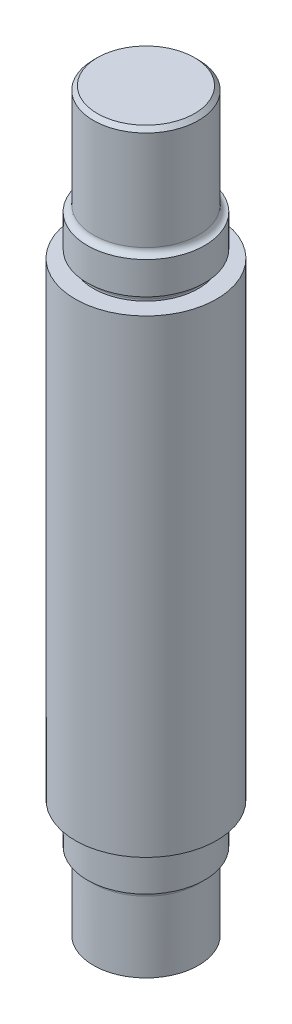
ISO-10303-21;
HEADER;
FILE_DESCRIPTION(('STEP AP214'),'2;1');
FILE_NAME('part.step','',(''),(''),'','','');
FILE_SCHEMA(('AUTOMOTIVE_DESIGN { 1 0 10303 214 1 1 1 1 }'));
ENDSEC;
DATA;
#1=APPLICATION_CONTEXT('core data for automotive mechanical design processes');
#2=APPLICATION_PROTOCOL_DEFINITION('international standard','automotive_design',2000,#1);
#3=PRODUCT_CONTEXT('',#1,'mechanical');
#4=PRODUCT('Part','Part','',(#3));
#5=PRODUCT_RELATED_PRODUCT_CATEGORY('part','',(#4));
#6=PRODUCT_DEFINITION_FORMATION('','',#4);
#7=PRODUCT_DEFINITION_CONTEXT('part definition',#1,'design');
#8=PRODUCT_DEFINITION('design','',#6,#7);
#9=PRODUCT_DEFINITION_SHAPE('','',#8);
#10=(LENGTH_UNIT() NAMED_UNIT(*) SI_UNIT(.MILLI.,.METRE.));
#11=(NAMED_UNIT(*) PLANE_ANGLE_UNIT() SI_UNIT($,.RADIAN.));
#12=(NAMED_UNIT(*) SI_UNIT($,.STERADIAN.) SOLID_ANGLE_UNIT());
#13=UNCERTAINTY_MEASURE_WITH_UNIT(LENGTH_MEASURE(1.E-05),#10,'distance_accuracy_value','');
#14=(GEOMETRIC_REPRESENTATION_CONTEXT(3) GLOBAL_UNCERTAINTY_ASSIGNED_CONTEXT((#13)) GLOBAL_UNIT_ASSIGNED_CONTEXT((#10,
#11,#12)) REPRESENTATION_CONTEXT('',''));
#15=CARTESIAN_POINT('',(0.,0.,0.));
#16=DIRECTION('',(0.,0.,1.));
#17=DIRECTION('',(1.,0.,0.));
#18=AXIS2_PLACEMENT_3D('',#15,#16,#17);
#19=CARTESIAN_POINT('',(-0.150000000000039,98.7262640233798,0.));
#20=DIRECTION('',(0.,1.,0.));
#21=DIRECTION('',(-1.,0.,0.));
#22=AXIS2_PLACEMENT_3D('',#19,#20,#21);
#23=CYLINDRICAL_SURFACE('',#22,22.4);
#24=CARTESIAN_POINT('',(-0.150000000000034,54.7262640233798,0.));
#25=DIRECTION('',(0.,1.,0.));
#26=DIRECTION('',(-1.,0.,0.));
#27=AXIS2_PLACEMENT_3D('',#24,#25,#26);
#28=CIRCLE('',#27,22.4);
#29=CARTESIAN_POINT('',(-22.55,54.7262640233798,0.));
#30=VERTEX_POINT('',#29);
#31=EDGE_CURVE('E56',#30,#30,#28,.T.);
#32=ORIENTED_EDGE('',*,*,#31,.T.);
#33=EDGE_LOOP('',(#32));
#34=FACE_BOUND('',#33,.T.);
#35=CARTESIAN_POINT('',(-0.150000000000039,97.0262640233799,0.));
#36=DIRECTION('',(0.,1.,0.));
#37=DIRECTION('',(-1.,0.,0.));
#38=AXIS2_PLACEMENT_3D('',#35,#36,#37);
#39=CIRCLE('',#38,22.4);
#40=CARTESIAN_POINT('',(-22.55,97.0262640233799,0.));
#41=VERTEX_POINT('',#40);
#42=EDGE_CURVE('E62',#41,#41,#39,.F.);
#43=ORIENTED_EDGE('',*,*,#42,.T.);
#44=EDGE_LOOP('',(#43));
#45=FACE_BOUND('',#44,.T.);
#46=ADVANCED_FACE('F38',(#34,#45),#23,.T.);
#47=CARTESIAN_POINT('',(-0.150000000000039,98.7262640233798,0.));
#48=DIRECTION('',(0.,1.,0.));
#49=DIRECTION('',(-1.,0.,0.));
#50=AXIS2_PLACEMENT_3D('',#47,#48,#49);
#51=CYLINDRICAL_SURFACE('',#50,25.);
#52=CARTESIAN_POINT('',(-0.150000000000032,38.3262640233798,0.));
#53=DIRECTION('',(0.,1.,0.));
#54=DIRECTION('',(-1.,0.,0.));
#55=AXIS2_PLACEMENT_3D('',#52,#53,#54);
#56=CIRCLE('',#55,25.);
#57=CARTESIAN_POINT('',(-25.15,38.3262640233798,0.));
#58=VERTEX_POINT('',#57);
#59=EDGE_CURVE('E74',#58,#58,#56,.T.);
#60=ORIENTED_EDGE('',*,*,#59,.T.);
#61=EDGE_LOOP('',(#60));
#62=FACE_BOUND('',#61,.T.);
#63=CARTESIAN_POINT('',(-0.150000000000034,52.1262640233798,0.));
#64=DIRECTION('',(0.,1.,0.));
#65=DIRECTION('',(-1.,0.,0.));
#66=AXIS2_PLACEMENT_3D('',#63,#64,#65);
#67=CIRCLE('',#66,25.);
#68=CARTESIAN_POINT('',(-25.15,52.1262640233798,0.));
#69=VERTEX_POINT('',#68);
#70=EDGE_CURVE('E70',#69,#69,#67,.T.);
#71=ORIENTED_EDGE('',*,*,#70,.F.);
#72=EDGE_LOOP('',(#71));
#73=FACE_BOUND('',#72,.T.);
#74=ADVANCED_FACE('F123',(#62,#73),#51,.T.);
#75=CARTESIAN_POINT('',(-0.150000000000039,98.7262640233798,0.));
#76=DIRECTION('',(0.,1.,0.));
#77=DIRECTION('',(-1.,0.,0.));
#78=AXIS2_PLACEMENT_3D('',#75,#76,#77);
#79=CYLINDRICAL_SURFACE('',#78,22.4);
#80=CARTESIAN_POINT('',(-0.150000000000032,35.7262640233798,0.));
#81=DIRECTION('',(0.,-1.,0.));
#82=DIRECTION('',(1.,0.,0.));
#83=AXIS2_PLACEMENT_3D('',#80,#81,#82);
#84=CIRCLE('',#83,22.4);
#85=CARTESIAN_POINT('',(22.2499999999999,35.7262640233798,0.));
#86=VERTEX_POINT('',#85);
#87=EDGE_CURVE('E51',#86,#86,#84,.T.);
#88=ORIENTED_EDGE('',*,*,#87,.T.);
#89=EDGE_LOOP('',(#88));
#90=FACE_BOUND('',#89,.T.);
#91=CARTESIAN_POINT('',(-0.150000000000031,34.9262640233798,0.));
#92=DIRECTION('',(0.,1.,0.));
#93=DIRECTION('',(-1.,0.,0.));
#94=AXIS2_PLACEMENT_3D('',#91,#92,#93);
#95=CIRCLE('',#94,22.4);
#96=CARTESIAN_POINT('',(-22.55,34.9262640233798,0.));
#97=VERTEX_POINT('',#96);
#98=EDGE_CURVE('E78',#97,#97,#95,.T.);
#99=ORIENTED_EDGE('',*,*,#98,.T.);
#100=EDGE_LOOP('',(#99));
#101=FACE_BOUND('',#100,.T.);
#102=ADVANCED_FACE('F129',(#90,#101),#79,.T.);
#103=CARTESIAN_POINT('',(-22.55,34.9262640233798,0.));
#104=DIRECTION('',(0.,1.,0.));
#105=DIRECTION('',(-1.,0.,0.));
#106=AXIS2_PLACEMENT_3D('',#103,#104,#105);
#107=PLANE('',#106);
#108=CARTESIAN_POINT('',(-0.150000000000031,34.9262640233798,0.));
#109=DIRECTION('',(0.,1.,0.));
#110=DIRECTION('',(-1.,0.,0.));
#111=AXIS2_PLACEMENT_3D('',#108,#109,#110);
#112=CIRCLE('',#111,30.15);
#113=CARTESIAN_POINT('',(-30.3,34.9262640233798,0.));
#114=VERTEX_POINT('',#113);
#115=EDGE_CURVE('E82',#114,#114,#112,.T.);
#116=ORIENTED_EDGE('',*,*,#115,.T.);
#117=EDGE_LOOP('',(#116));
#118=FACE_BOUND('',#117,.T.);
#119=ORIENTED_EDGE('',*,*,#98,.F.);
#120=EDGE_LOOP('',(#119));
#121=FACE_BOUND('',#120,.T.);
#122=ADVANCED_FACE('F173',(#118,#121),#107,.T.);
#123=CARTESIAN_POINT('',(-0.150000000000039,98.7262640233798,0.));
#124=DIRECTION('',(0.,1.,0.));
#125=DIRECTION('',(-1.,0.,0.));
#126=AXIS2_PLACEMENT_3D('',#123,#124,#125);
#127=CYLINDRICAL_SURFACE('',#126,30.15);
#128=CARTESIAN_POINT('',(-0.150000000000008,-165.07373597662,0.));
#129=DIRECTION('',(0.,1.,0.));
#130=DIRECTION('',(-1.,0.,0.));
#131=AXIS2_PLACEMENT_3D('',#128,#129,#130);
#132=CIRCLE('',#131,30.15);
#133=CARTESIAN_POINT('',(-30.3,-165.07373597662,0.));
#134=VERTEX_POINT('',#133);
#135=EDGE_CURVE('E86',#134,#134,#132,.T.);
#136=ORIENTED_EDGE('',*,*,#135,.T.);
#137=EDGE_LOOP('',(#136));
#138=FACE_BOUND('',#137,.T.);
#139=ORIENTED_EDGE('',*,*,#115,.F.);
#140=EDGE_LOOP('',(#139));
#141=FACE_BOUND('',#140,.T.);
#142=ADVANCED_FACE('F169',(#138,#141),#127,.T.);
#143=CARTESIAN_POINT('',(-22.55,-165.07373597662,0.));
#144=DIRECTION('',(0.,-1.,0.));
#145=DIRECTION('',(1.,0.,0.));
#146=AXIS2_PLACEMENT_3D('',#143,#144,#145);
#147=PLANE('',#146);
#148=CARTESIAN_POINT('',(-0.150000000000008,-165.07373597662,0.));
#149=DIRECTION('',(0.,1.,0.));
#150=DIRECTION('',(-1.,0.,0.));
#151=AXIS2_PLACEMENT_3D('',#148,#149,#150);
#152=CIRCLE('',#151,22.4);
#153=CARTESIAN_POINT('',(-22.55,-165.07373597662,0.));
#154=VERTEX_POINT('',#153);
#155=EDGE_CURVE('E90',#154,#154,#152,.T.);
#156=ORIENTED_EDGE('',*,*,#155,.T.);
#157=EDGE_LOOP('',(#156));
#158=FACE_BOUND('',#157,.T.);
#159=ORIENTED_EDGE('',*,*,#135,.F.);
#160=EDGE_LOOP('',(#159));
#161=FACE_BOUND('',#160,.T.);
#162=ADVANCED_FACE('F164',(#158,#161),#147,.T.);
#163=CARTESIAN_POINT('',(-0.150000000000039,98.7262640233798,0.));
#164=DIRECTION('',(0.,1.,0.));
#165=DIRECTION('',(-1.,0.,0.));
#166=AXIS2_PLACEMENT_3D('',#163,#164,#165);
#167=CYLINDRICAL_SURFACE('',#166,22.4);
#168=CARTESIAN_POINT('',(-0.150000000000008,-165.87373597662,0.));
#169=DIRECTION('',(0.,1.,0.));
#170=DIRECTION('',(-1.,0.,0.));
#171=AXIS2_PLACEMENT_3D('',#168,#169,#170);
#172=CIRCLE('',#171,22.4);
#173=CARTESIAN_POINT('',(-22.55,-165.87373597662,0.));
#174=VERTEX_POINT('',#173);
#175=EDGE_CURVE('E10',#174,#174,#172,.T.);
#176=ORIENTED_EDGE('',*,*,#175,.T.);
#177=EDGE_LOOP('',(#176));
#178=FACE_BOUND('',#177,.T.);
#179=ORIENTED_EDGE('',*,*,#155,.F.);
#180=EDGE_LOOP('',(#179));
#181=FACE_BOUND('',#180,.T.);
#182=ADVANCED_FACE('F157',(#178,#181),#167,.T.);
#183=CARTESIAN_POINT('',(-0.150000000000039,98.7262640233798,0.));
#184=DIRECTION('',(0.,1.,0.));
#185=DIRECTION('',(-1.,0.,0.));
#186=AXIS2_PLACEMENT_3D('',#183,#184,#185);
#187=CYLINDRICAL_SURFACE('',#186,25.);
#188=CARTESIAN_POINT('',(-0.150000000000006,-182.27373597662,0.));
#189=DIRECTION('',(0.,1.,0.));
#190=DIRECTION('',(-1.,0.,0.));
#191=AXIS2_PLACEMENT_3D('',#188,#189,#190);
#192=CIRCLE('',#191,25.);
#193=CARTESIAN_POINT('',(-25.15,-182.27373597662,0.));
#194=VERTEX_POINT('',#193);
#195=EDGE_CURVE('E98',#194,#194,#192,.T.);
#196=ORIENTED_EDGE('',*,*,#195,.T.);
#197=EDGE_LOOP('',(#196));
#198=FACE_BOUND('',#197,.T.);
#199=CARTESIAN_POINT('',(-0.150000000000008,-168.47373597662,0.));
#200=DIRECTION('',(0.,1.,0.));
#201=DIRECTION('',(-1.,0.,0.));
#202=AXIS2_PLACEMENT_3D('',#199,#200,#201);
#203=CIRCLE('',#202,25.);
#204=CARTESIAN_POINT('',(-25.15,-168.47373597662,0.));
#205=VERTEX_POINT('',#204);
#206=EDGE_CURVE('E94',#205,#205,#203,.T.);
#207=ORIENTED_EDGE('',*,*,#206,.F.);
#208=EDGE_LOOP('',(#207));
#209=FACE_BOUND('',#208,.T.);
#210=ADVANCED_FACE('F120',(#198,#209),#187,.T.);
#211=CARTESIAN_POINT('',(-0.150000000000039,98.7262640233798,0.));
#212=DIRECTION('',(0.,1.,0.));
#213=DIRECTION('',(-1.,0.,0.));
#214=AXIS2_PLACEMENT_3D('',#211,#212,#213);
#215=CYLINDRICAL_SURFACE('',#214,22.4);
#216=CARTESIAN_POINT('',(-0.150000000000006,-184.87373597662,0.));
#217=DIRECTION('',(0.,-1.,0.));
#218=DIRECTION('',(1.,0.,0.));
#219=AXIS2_PLACEMENT_3D('',#216,#217,#218);
#220=CIRCLE('',#219,22.4);
#221=CARTESIAN_POINT('',(22.25,-184.87373597662,0.));
#222=VERTEX_POINT('',#221);
#223=EDGE_CURVE('E46',#222,#222,#220,.T.);
#224=ORIENTED_EDGE('',*,*,#223,.T.);
#225=EDGE_LOOP('',(#224));
#226=FACE_BOUND('',#225,.T.);
#227=CARTESIAN_POINT('',(-0.150000000000002,-215.07373597662,0.));
#228=DIRECTION('',(0.,1.,0.));
#229=DIRECTION('',(-1.,0.,0.));
#230=AXIS2_PLACEMENT_3D('',#227,#228,#229);
#231=CIRCLE('',#230,22.4);
#232=CARTESIAN_POINT('',(-22.55,-215.07373597662,0.));
#233=VERTEX_POINT('',#232);
#234=EDGE_CURVE('E102',#233,#233,#231,.T.);
#235=ORIENTED_EDGE('',*,*,#234,.T.);
#236=EDGE_LOOP('',(#235));
#237=FACE_BOUND('',#236,.T.);
#238=ADVANCED_FACE('F107',(#226,#237),#215,.T.);
#239=CARTESIAN_POINT('',(-22.55,-215.07373597662,0.));
#240=DIRECTION('',(0.,-1.,0.));
#241=DIRECTION('',(1.,0.,0.));
#242=AXIS2_PLACEMENT_3D('',#239,#240,#241);
#243=PLANE('',#242);
#244=ORIENTED_EDGE('',*,*,#234,.F.);
#245=EDGE_LOOP('',(#244));
#246=FACE_BOUND('',#245,.T.);
#247=ADVANCED_FACE('F109',(#246),#243,.T.);
#248=CARTESIAN_POINT('',(-22.55,98.7262640233798,0.));
#249=DIRECTION('',(0.,1.,0.));
#250=DIRECTION('',(-1.,0.,0.));
#251=AXIS2_PLACEMENT_3D('',#248,#249,#250);
#252=PLANE('',#251);
#253=CARTESIAN_POINT('',(-0.150000000000039,98.7262640233798,0.));
#254=DIRECTION('',(0.,1.,0.));
#255=DIRECTION('',(-1.,0.,0.));
#256=AXIS2_PLACEMENT_3D('',#253,#254,#255);
#257=CIRCLE('',#256,20.7);
#258=CARTESIAN_POINT('',(-20.85,98.7262640233798,0.));
#259=VERTEX_POINT('',#258);
#260=EDGE_CURVE('E66',#259,#259,#257,.T.);
#261=ORIENTED_EDGE('',*,*,#260,.T.);
#262=EDGE_LOOP('',(#261));
#263=FACE_BOUND('',#262,.T.);
#264=ADVANCED_FACE('F111',(#263),#252,.T.);
#265=CARTESIAN_POINT('',(-0.150000000000039,98.7262640233798,0.));
#266=DIRECTION('',(0.,-1.,0.));
#267=DIRECTION('',(1.,0.,0.));
#268=AXIS2_PLACEMENT_3D('',#265,#266,#267);
#269=CONICAL_SURFACE('',#268,20.7,0.785398163397447);
#270=ORIENTED_EDGE('',*,*,#42,.F.);
#271=EDGE_LOOP('',(#270));
#272=FACE_BOUND('',#271,.T.);
#273=ORIENTED_EDGE('',*,*,#260,.F.);
#274=EDGE_LOOP('',(#273));
#275=FACE_BOUND('',#274,.T.);
#276=ADVANCED_FACE('F117',(#272,#275),#269,.T.);
#277=CARTESIAN_POINT('',(-0.150000000000034,54.7262640233798,0.));
#278=DIRECTION('',(0.,1.,0.));
#279=DIRECTION('',(-1.,0.,0.));
#280=AXIS2_PLACEMENT_3D('',#277,#278,#279);
#281=TOROIDAL_SURFACE('',#280,25.,2.6);
#282=ORIENTED_EDGE('',*,*,#70,.T.);
#283=EDGE_LOOP('',(#282));
#284=FACE_BOUND('',#283,.T.);
#285=ORIENTED_EDGE('',*,*,#31,.F.);
#286=EDGE_LOOP('',(#285));
#287=FACE_BOUND('',#286,.T.);
#288=ADVANCED_FACE('F137',(#284,#287),#281,.F.);
#289=CARTESIAN_POINT('',(-0.150000000000032,35.7262640233798,0.));
#290=DIRECTION('',(0.,-1.,0.));
#291=DIRECTION('',(1.,0.,0.));
#292=AXIS2_PLACEMENT_3D('',#289,#290,#291);
#293=TOROIDAL_SURFACE('',#292,25.,2.6);
#294=ORIENTED_EDGE('',*,*,#87,.F.);
#295=EDGE_LOOP('',(#294));
#296=FACE_BOUND('',#295,.T.);
#297=ORIENTED_EDGE('',*,*,#59,.F.);
#298=EDGE_LOOP('',(#297));
#299=FACE_BOUND('',#298,.T.);
#300=ADVANCED_FACE('F141',(#296,#299),#293,.F.);
#301=CARTESIAN_POINT('',(-0.150000000000006,-184.87373597662,0.));
#302=DIRECTION('',(0.,-1.,0.));
#303=DIRECTION('',(1.,0.,0.));
#304=AXIS2_PLACEMENT_3D('',#301,#302,#303);
#305=TOROIDAL_SURFACE('',#304,25.,2.6);
#306=ORIENTED_EDGE('',*,*,#223,.F.);
#307=EDGE_LOOP('',(#306));
#308=FACE_BOUND('',#307,.T.);
#309=ORIENTED_EDGE('',*,*,#195,.F.);
#310=EDGE_LOOP('',(#309));
#311=FACE_BOUND('',#310,.T.);
#312=ADVANCED_FACE('F144',(#308,#311),#305,.F.);
#313=CARTESIAN_POINT('',(-0.150000000000008,-165.87373597662,0.));
#314=DIRECTION('',(0.,1.,0.));
#315=DIRECTION('',(-1.,0.,0.));
#316=AXIS2_PLACEMENT_3D('',#313,#314,#315);
#317=TOROIDAL_SURFACE('',#316,25.,2.6);
#318=ORIENTED_EDGE('',*,*,#206,.T.);
#319=EDGE_LOOP('',(#318));
#320=FACE_BOUND('',#319,.T.);
#321=ORIENTED_EDGE('',*,*,#175,.F.);
#322=EDGE_LOOP('',(#321));
#323=FACE_BOUND('',#322,.T.);
#324=ADVANCED_FACE('F40',(#320,#323),#317,.F.);
#325=CLOSED_SHELL('',(#46,#74,#102,#122,#142,#162,#182,#210,#238,#247,#264,#276,#288,#300,#312,#324));
#326=MANIFOLD_SOLID_BREP('B2',#325);
#327=ADVANCED_BREP_SHAPE_REPRESENTATION('',(#18,#326),#14);
#328=SHAPE_DEFINITION_REPRESENTATION(#9,#327);
ENDSEC;
END-ISO-10303-21;
